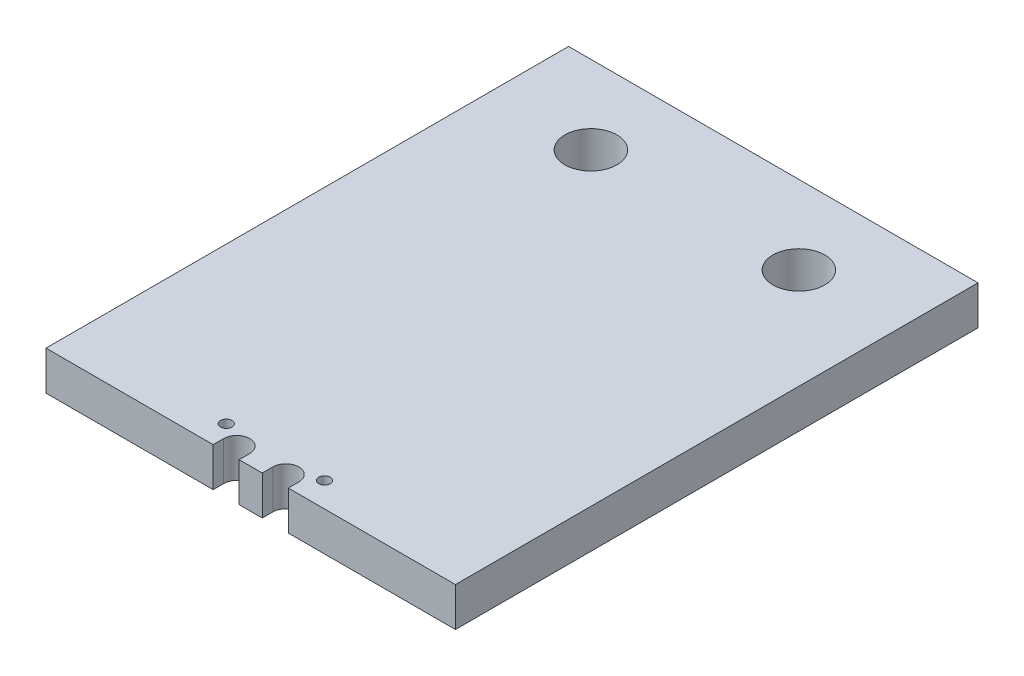
ISO-10303-21;
HEADER;
FILE_DESCRIPTION(('STEP AP214'),'2;1');
FILE_NAME('part.step','',(''),(''),'','','');
FILE_SCHEMA(('AUTOMOTIVE_DESIGN { 1 0 10303 214 1 1 1 1 }'));
ENDSEC;
DATA;
#1=APPLICATION_CONTEXT('core data for automotive mechanical design processes');
#2=APPLICATION_PROTOCOL_DEFINITION('international standard','automotive_design',2000,#1);
#3=PRODUCT_CONTEXT('',#1,'mechanical');
#4=PRODUCT('Part','Part','',(#3));
#5=PRODUCT_RELATED_PRODUCT_CATEGORY('part','',(#4));
#6=PRODUCT_DEFINITION_FORMATION('','',#4);
#7=PRODUCT_DEFINITION_CONTEXT('part definition',#1,'design');
#8=PRODUCT_DEFINITION('design','',#6,#7);
#9=PRODUCT_DEFINITION_SHAPE('','',#8);
#10=(LENGTH_UNIT() NAMED_UNIT(*) SI_UNIT(.MILLI.,.METRE.));
#11=(NAMED_UNIT(*) PLANE_ANGLE_UNIT() SI_UNIT($,.RADIAN.));
#12=(NAMED_UNIT(*) SI_UNIT($,.STERADIAN.) SOLID_ANGLE_UNIT());
#13=UNCERTAINTY_MEASURE_WITH_UNIT(LENGTH_MEASURE(1.E-05),#10,'distance_accuracy_value','');
#14=(GEOMETRIC_REPRESENTATION_CONTEXT(3) GLOBAL_UNCERTAINTY_ASSIGNED_CONTEXT((#13)) GLOBAL_UNIT_ASSIGNED_CONTEXT((#10,
#11,#12)) REPRESENTATION_CONTEXT('',''));
#15=CARTESIAN_POINT('',(0.,0.,0.));
#16=DIRECTION('',(0.,0.,1.));
#17=DIRECTION('',(1.,0.,0.));
#18=AXIS2_PLACEMENT_3D('',#15,#16,#17);
#19=CARTESIAN_POINT('',(16.,-4.7625,-1.18513126604703));
#20=DIRECTION('',(-1.,0.,0.));
#21=DIRECTION('',(0.,0.,1.));
#22=AXIS2_PLACEMENT_3D('',#19,#20,#21);
#23=PLANE('',#22);
#24=DIRECTION('',(0.,0.,1.));
#25=VECTOR('',#24,1.);
#26=CARTESIAN_POINT('',(16.,0.,-1.18513126604703));
#27=LINE('',#26,#25);
#28=CARTESIAN_POINT('',(16.,0.,-65.));
#29=VERTEX_POINT('',#28);
#30=CARTESIAN_POINT('',(16.,0.,-1.18513126604703));
#31=VERTEX_POINT('',#30);
#32=EDGE_CURVE('E154',#29,#31,#27,.T.);
#33=ORIENTED_EDGE('',*,*,#32,.F.);
#34=DIRECTION('',(0.,1.,0.));
#35=VECTOR('',#34,1.);
#36=CARTESIAN_POINT('',(16.,-4.7625,-65.));
#37=LINE('',#36,#35);
#38=CARTESIAN_POINT('',(16.,-4.7625,-65.));
#39=VERTEX_POINT('',#38);
#40=EDGE_CURVE('E11',#39,#29,#37,.T.);
#41=ORIENTED_EDGE('',*,*,#40,.F.);
#42=DIRECTION('',(0.,0.,1.));
#43=VECTOR('',#42,1.);
#44=CARTESIAN_POINT('',(16.,-4.7625,-1.18513126604703));
#45=LINE('',#44,#43);
#46=CARTESIAN_POINT('',(16.,-4.7625,-1.18513126604703));
#47=VERTEX_POINT('',#46);
#48=EDGE_CURVE('E187',#39,#47,#45,.T.);
#49=ORIENTED_EDGE('',*,*,#48,.T.);
#50=DIRECTION('',(0.,1.,0.));
#51=VECTOR('',#50,1.);
#52=CARTESIAN_POINT('',(16.,-4.7625,-1.18513126604703));
#53=LINE('',#52,#51);
#54=EDGE_CURVE('E36',#47,#31,#53,.T.);
#55=ORIENTED_EDGE('',*,*,#54,.T.);
#56=EDGE_LOOP('',(#33,#41,#49,#55));
#57=FACE_BOUND('',#56,.T.);
#58=ADVANCED_FACE('F33',(#57),#23,.T.);
#59=CARTESIAN_POINT('',(16.,-4.7625,-65.));
#60=DIRECTION('',(0.,0.,-1.));
#61=DIRECTION('',(-1.,0.,0.));
#62=AXIS2_PLACEMENT_3D('',#59,#60,#61);
#63=PLANE('',#62);
#64=DIRECTION('',(-1.,0.,0.));
#65=VECTOR('',#64,1.);
#66=CARTESIAN_POINT('',(16.,0.,-65.));
#67=LINE('',#66,#65);
#68=CARTESIAN_POINT('',(66.,0.,-65.));
#69=VERTEX_POINT('',#68);
#70=EDGE_CURVE('E185',#69,#29,#67,.T.);
#71=ORIENTED_EDGE('',*,*,#70,.F.);
#72=DIRECTION('',(0.,1.,0.));
#73=VECTOR('',#72,1.);
#74=CARTESIAN_POINT('',(66.,-4.7625,-65.));
#75=LINE('',#74,#73);
#76=CARTESIAN_POINT('',(66.,-4.7625,-65.));
#77=VERTEX_POINT('',#76);
#78=EDGE_CURVE('E42',#77,#69,#75,.T.);
#79=ORIENTED_EDGE('',*,*,#78,.F.);
#80=DIRECTION('',(-1.,0.,0.));
#81=VECTOR('',#80,1.);
#82=CARTESIAN_POINT('',(16.,-4.7625,-65.));
#83=LINE('',#82,#81);
#84=EDGE_CURVE('E144',#77,#39,#83,.T.);
#85=ORIENTED_EDGE('',*,*,#84,.T.);
#86=ORIENTED_EDGE('',*,*,#40,.T.);
#87=EDGE_LOOP('',(#71,#79,#85,#86));
#88=FACE_BOUND('',#87,.T.);
#89=ADVANCED_FACE('F207',(#88),#63,.T.);
#90=CARTESIAN_POINT('',(66.,-4.7625,-1.18513126604705));
#91=DIRECTION('',(1.,0.,0.));
#92=DIRECTION('',(0.,0.,-1.));
#93=AXIS2_PLACEMENT_3D('',#90,#91,#92);
#94=PLANE('',#93);
#95=DIRECTION('',(0.,0.,-1.));
#96=VECTOR('',#95,1.);
#97=CARTESIAN_POINT('',(66.,0.,-1.18513126604705));
#98=LINE('',#97,#96);
#99=CARTESIAN_POINT('',(66.,0.,-1.18513126604705));
#100=VERTEX_POINT('',#99);
#101=EDGE_CURVE('E131',#100,#69,#98,.T.);
#102=ORIENTED_EDGE('',*,*,#101,.F.);
#103=DIRECTION('',(0.,1.,0.));
#104=VECTOR('',#103,1.);
#105=CARTESIAN_POINT('',(66.,-4.7625,-1.18513126604705));
#106=LINE('',#105,#104);
#107=CARTESIAN_POINT('',(66.,-4.7625,-1.18513126604705));
#108=VERTEX_POINT('',#107);
#109=EDGE_CURVE('E126',#108,#100,#106,.T.);
#110=ORIENTED_EDGE('',*,*,#109,.F.);
#111=DIRECTION('',(0.,0.,-1.));
#112=VECTOR('',#111,1.);
#113=CARTESIAN_POINT('',(66.,-4.7625,-1.18513126604705));
#114=LINE('',#113,#112);
#115=EDGE_CURVE('E129',#108,#77,#114,.T.);
#116=ORIENTED_EDGE('',*,*,#115,.T.);
#117=ORIENTED_EDGE('',*,*,#78,.T.);
#118=EDGE_LOOP('',(#102,#110,#116,#117));
#119=FACE_BOUND('',#118,.T.);
#120=ADVANCED_FACE('F128',(#119),#94,.T.);
#121=CARTESIAN_POINT('',(66.,-4.7625,-1.18513126604705));
#122=DIRECTION('',(0.,0.,1.));
#123=DIRECTION('',(1.,0.,0.));
#124=AXIS2_PLACEMENT_3D('',#121,#122,#123);
#125=PLANE('',#124);
#126=DIRECTION('',(1.,0.,0.));
#127=VECTOR('',#126,1.);
#128=CARTESIAN_POINT('',(66.,0.,-1.18513126604705));
#129=LINE('',#128,#127);
#130=CARTESIAN_POINT('',(45.5875,0.,-1.18513126604703));
#131=VERTEX_POINT('',#130);
#132=EDGE_CURVE('E182',#131,#100,#129,.T.);
#133=ORIENTED_EDGE('',*,*,#132,.F.);
#134=DIRECTION('',(0.,1.,0.));
#135=VECTOR('',#134,1.);
#136=CARTESIAN_POINT('',(45.5875,-4.7625,-1.18513126604703));
#137=LINE('',#136,#135);
#138=CARTESIAN_POINT('',(45.5875,-4.7625,-1.18513126604703));
#139=VERTEX_POINT('',#138);
#140=EDGE_CURVE('E136',#139,#131,#137,.T.);
#141=ORIENTED_EDGE('',*,*,#140,.F.);
#142=DIRECTION('',(1.,0.,0.));
#143=VECTOR('',#142,1.);
#144=CARTESIAN_POINT('',(66.,-4.7625,-1.18513126604705));
#145=LINE('',#144,#143);
#146=EDGE_CURVE('E142',#139,#108,#145,.T.);
#147=ORIENTED_EDGE('',*,*,#146,.T.);
#148=ORIENTED_EDGE('',*,*,#109,.T.);
#149=EDGE_LOOP('',(#133,#141,#147,#148));
#150=FACE_BOUND('',#149,.T.);
#151=ADVANCED_FACE('F146',(#150),#125,.T.);
#152=CARTESIAN_POINT('',(45.5875,-4.7625,-2.47623547973613));
#153=DIRECTION('',(-1.,0.,0.));
#154=DIRECTION('',(0.,0.,1.));
#155=AXIS2_PLACEMENT_3D('',#152,#153,#154);
#156=PLANE('',#155);
#157=DIRECTION('',(0.,0.,1.));
#158=VECTOR('',#157,1.);
#159=CARTESIAN_POINT('',(45.5875,0.,-2.47623547973613));
#160=LINE('',#159,#158);
#161=CARTESIAN_POINT('',(45.5875,0.,-2.47623547973613));
#162=VERTEX_POINT('',#161);
#163=EDGE_CURVE('E179',#162,#131,#160,.T.);
#164=ORIENTED_EDGE('',*,*,#163,.F.);
#165=DIRECTION('',(0.,1.,0.));
#166=VECTOR('',#165,1.);
#167=CARTESIAN_POINT('',(45.5875,-4.7625,-2.47623547973613));
#168=LINE('',#167,#166);
#169=CARTESIAN_POINT('',(45.5875,-4.7625,-2.47623547973613));
#170=VERTEX_POINT('',#169);
#171=EDGE_CURVE('E191',#170,#162,#168,.T.);
#172=ORIENTED_EDGE('',*,*,#171,.F.);
#173=DIRECTION('',(0.,0.,1.));
#174=VECTOR('',#173,1.);
#175=CARTESIAN_POINT('',(45.5875,-4.7625,-2.47623547973613));
#176=LINE('',#175,#174);
#177=EDGE_CURVE('E147',#170,#139,#176,.T.);
#178=ORIENTED_EDGE('',*,*,#177,.T.);
#179=ORIENTED_EDGE('',*,*,#140,.T.);
#180=EDGE_LOOP('',(#164,#172,#178,#179));
#181=FACE_BOUND('',#180,.T.);
#182=ADVANCED_FACE('F220',(#181),#156,.T.);
#183=CARTESIAN_POINT('',(44.,-4.7625,-2.47623547973613));
#184=DIRECTION('',(0.,1.,0.));
#185=DIRECTION('',(0.,0.,1.));
#186=AXIS2_PLACEMENT_3D('',#183,#184,#185);
#187=CYLINDRICAL_SURFACE('',#186,1.5875);
#188=CARTESIAN_POINT('',(44.,0.,-2.47623547973613));
#189=DIRECTION('',(0.,-1.,0.));
#190=DIRECTION('',(0.,0.,-1.));
#191=AXIS2_PLACEMENT_3D('',#188,#189,#190);
#192=CIRCLE('',#191,1.5875);
#193=CARTESIAN_POINT('',(42.4125,0.,-2.47623547973613));
#194=VERTEX_POINT('',#193);
#195=EDGE_CURVE('E176',#194,#162,#192,.T.);
#196=ORIENTED_EDGE('',*,*,#195,.F.);
#197=DIRECTION('',(0.,1.,0.));
#198=VECTOR('',#197,1.);
#199=CARTESIAN_POINT('',(42.4125,-4.7625,-2.47623547973613));
#200=LINE('',#199,#198);
#201=CARTESIAN_POINT('',(42.4125,-4.7625,-2.47623547973613));
#202=VERTEX_POINT('',#201);
#203=EDGE_CURVE('E193',#202,#194,#200,.T.);
#204=ORIENTED_EDGE('',*,*,#203,.F.);
#205=CARTESIAN_POINT('',(44.,-4.7625,-2.47623547973613));
#206=DIRECTION('',(0.,-1.,0.));
#207=DIRECTION('',(0.,0.,-1.));
#208=AXIS2_PLACEMENT_3D('',#205,#206,#207);
#209=CIRCLE('',#208,1.5875);
#210=EDGE_CURVE('E149',#202,#170,#209,.T.);
#211=ORIENTED_EDGE('',*,*,#210,.T.);
#212=ORIENTED_EDGE('',*,*,#171,.T.);
#213=EDGE_LOOP('',(#196,#204,#211,#212));
#214=FACE_BOUND('',#213,.T.);
#215=ADVANCED_FACE('F223',(#214),#187,.F.);
#216=CARTESIAN_POINT('',(42.4125,-4.7625,-1.18513126604703));
#217=DIRECTION('',(1.,0.,0.));
#218=DIRECTION('',(0.,0.,-1.));
#219=AXIS2_PLACEMENT_3D('',#216,#217,#218);
#220=PLANE('',#219);
#221=DIRECTION('',(0.,0.,-1.));
#222=VECTOR('',#221,1.);
#223=CARTESIAN_POINT('',(42.4125,0.,-1.18513126604703));
#224=LINE('',#223,#222);
#225=CARTESIAN_POINT('',(42.4125,0.,-1.18513126604703));
#226=VERTEX_POINT('',#225);
#227=EDGE_CURVE('E173',#226,#194,#224,.T.);
#228=ORIENTED_EDGE('',*,*,#227,.F.);
#229=DIRECTION('',(0.,1.,0.));
#230=VECTOR('',#229,1.);
#231=CARTESIAN_POINT('',(42.4125,-4.7625,-1.18513126604703));
#232=LINE('',#231,#230);
#233=CARTESIAN_POINT('',(42.4125,-4.7625,-1.18513126604703));
#234=VERTEX_POINT('',#233);
#235=EDGE_CURVE('E195',#234,#226,#232,.T.);
#236=ORIENTED_EDGE('',*,*,#235,.F.);
#237=DIRECTION('',(0.,0.,-1.));
#238=VECTOR('',#237,1.);
#239=CARTESIAN_POINT('',(42.4125,-4.7625,-1.18513126604703));
#240=LINE('',#239,#238);
#241=EDGE_CURVE('E317',#234,#202,#240,.T.);
#242=ORIENTED_EDGE('',*,*,#241,.T.);
#243=ORIENTED_EDGE('',*,*,#203,.T.);
#244=EDGE_LOOP('',(#228,#236,#242,#243));
#245=FACE_BOUND('',#244,.T.);
#246=ADVANCED_FACE('F227',(#245),#220,.T.);
#247=CARTESIAN_POINT('',(42.4125,-4.7625,-1.18513126604703));
#248=DIRECTION('',(0.,0.,1.));
#249=DIRECTION('',(1.,0.,0.));
#250=AXIS2_PLACEMENT_3D('',#247,#248,#249);
#251=PLANE('',#250);
#252=DIRECTION('',(1.,0.,0.));
#253=VECTOR('',#252,1.);
#254=CARTESIAN_POINT('',(42.4125,0.,-1.18513126604703));
#255=LINE('',#254,#253);
#256=CARTESIAN_POINT('',(39.5875,0.,-1.18513126604703));
#257=VERTEX_POINT('',#256);
#258=EDGE_CURVE('E170',#257,#226,#255,.T.);
#259=ORIENTED_EDGE('',*,*,#258,.F.);
#260=DIRECTION('',(0.,1.,0.));
#261=VECTOR('',#260,1.);
#262=CARTESIAN_POINT('',(39.5875,-4.7625,-1.18513126604703));
#263=LINE('',#262,#261);
#264=CARTESIAN_POINT('',(39.5875,-4.7625,-1.18513126604703));
#265=VERTEX_POINT('',#264);
#266=EDGE_CURVE('E197',#265,#257,#263,.T.);
#267=ORIENTED_EDGE('',*,*,#266,.F.);
#268=DIRECTION('',(1.,0.,0.));
#269=VECTOR('',#268,1.);
#270=CARTESIAN_POINT('',(42.4125,-4.7625,-1.18513126604703));
#271=LINE('',#270,#269);
#272=EDGE_CURVE('E314',#265,#234,#271,.T.);
#273=ORIENTED_EDGE('',*,*,#272,.T.);
#274=ORIENTED_EDGE('',*,*,#235,.T.);
#275=EDGE_LOOP('',(#259,#267,#273,#274));
#276=FACE_BOUND('',#275,.T.);
#277=ADVANCED_FACE('F231',(#276),#251,.T.);
#278=CARTESIAN_POINT('',(39.5875,-4.7625,-2.47623547973613));
#279=DIRECTION('',(-1.,0.,0.));
#280=DIRECTION('',(0.,0.,1.));
#281=AXIS2_PLACEMENT_3D('',#278,#279,#280);
#282=PLANE('',#281);
#283=DIRECTION('',(0.,0.,1.));
#284=VECTOR('',#283,1.);
#285=CARTESIAN_POINT('',(39.5875,0.,-2.47623547973613));
#286=LINE('',#285,#284);
#287=CARTESIAN_POINT('',(39.5875,0.,-2.47623547973613));
#288=VERTEX_POINT('',#287);
#289=EDGE_CURVE('E167',#288,#257,#286,.T.);
#290=ORIENTED_EDGE('',*,*,#289,.F.);
#291=DIRECTION('',(0.,1.,0.));
#292=VECTOR('',#291,1.);
#293=CARTESIAN_POINT('',(39.5875,-4.7625,-2.47623547973613));
#294=LINE('',#293,#292);
#295=CARTESIAN_POINT('',(39.5875,-4.7625,-2.47623547973613));
#296=VERTEX_POINT('',#295);
#297=EDGE_CURVE('E199',#296,#288,#294,.T.);
#298=ORIENTED_EDGE('',*,*,#297,.F.);
#299=DIRECTION('',(0.,0.,1.));
#300=VECTOR('',#299,1.);
#301=CARTESIAN_POINT('',(39.5875,-4.7625,-2.47623547973613));
#302=LINE('',#301,#300);
#303=EDGE_CURVE('E311',#296,#265,#302,.T.);
#304=ORIENTED_EDGE('',*,*,#303,.T.);
#305=ORIENTED_EDGE('',*,*,#266,.T.);
#306=EDGE_LOOP('',(#290,#298,#304,#305));
#307=FACE_BOUND('',#306,.T.);
#308=ADVANCED_FACE('F235',(#307),#282,.T.);
#309=CARTESIAN_POINT('',(38.,-4.7625,-2.47623547973613));
#310=DIRECTION('',(0.,1.,0.));
#311=DIRECTION('',(0.,0.,1.));
#312=AXIS2_PLACEMENT_3D('',#309,#310,#311);
#313=CYLINDRICAL_SURFACE('',#312,1.5875);
#314=CARTESIAN_POINT('',(38.,0.,-2.47623547973613));
#315=DIRECTION('',(0.,-1.,0.));
#316=DIRECTION('',(0.,0.,-1.));
#317=AXIS2_PLACEMENT_3D('',#314,#315,#316);
#318=CIRCLE('',#317,1.5875);
#319=CARTESIAN_POINT('',(36.4125,0.,-2.47623547973613));
#320=VERTEX_POINT('',#319);
#321=EDGE_CURVE('E164',#320,#288,#318,.T.);
#322=ORIENTED_EDGE('',*,*,#321,.F.);
#323=DIRECTION('',(0.,1.,0.));
#324=VECTOR('',#323,1.);
#325=CARTESIAN_POINT('',(36.4125,-4.7625,-2.47623547973613));
#326=LINE('',#325,#324);
#327=CARTESIAN_POINT('',(36.4125,-4.7625,-2.47623547973613));
#328=VERTEX_POINT('',#327);
#329=EDGE_CURVE('E201',#328,#320,#326,.T.);
#330=ORIENTED_EDGE('',*,*,#329,.F.);
#331=CARTESIAN_POINT('',(38.,-4.7625,-2.47623547973613));
#332=DIRECTION('',(0.,-1.,0.));
#333=DIRECTION('',(0.,0.,-1.));
#334=AXIS2_PLACEMENT_3D('',#331,#332,#333);
#335=CIRCLE('',#334,1.5875);
#336=EDGE_CURVE('E308',#328,#296,#335,.T.);
#337=ORIENTED_EDGE('',*,*,#336,.T.);
#338=ORIENTED_EDGE('',*,*,#297,.T.);
#339=EDGE_LOOP('',(#322,#330,#337,#338));
#340=FACE_BOUND('',#339,.T.);
#341=ADVANCED_FACE('F239',(#340),#313,.F.);
#342=CARTESIAN_POINT('',(36.4125,-4.7625,-1.18513126604703));
#343=DIRECTION('',(1.,0.,0.));
#344=DIRECTION('',(0.,0.,-1.));
#345=AXIS2_PLACEMENT_3D('',#342,#343,#344);
#346=PLANE('',#345);
#347=DIRECTION('',(0.,0.,-1.));
#348=VECTOR('',#347,1.);
#349=CARTESIAN_POINT('',(36.4125,0.,-1.18513126604703));
#350=LINE('',#349,#348);
#351=CARTESIAN_POINT('',(36.4125,0.,-1.18513126604703));
#352=VERTEX_POINT('',#351);
#353=EDGE_CURVE('E161',#352,#320,#350,.T.);
#354=ORIENTED_EDGE('',*,*,#353,.F.);
#355=DIRECTION('',(0.,1.,0.));
#356=VECTOR('',#355,1.);
#357=CARTESIAN_POINT('',(36.4125,-4.7625,-1.18513126604703));
#358=LINE('',#357,#356);
#359=CARTESIAN_POINT('',(36.4125,-4.7625,-1.18513126604703));
#360=VERTEX_POINT('',#359);
#361=EDGE_CURVE('E202',#360,#352,#358,.T.);
#362=ORIENTED_EDGE('',*,*,#361,.F.);
#363=DIRECTION('',(0.,0.,-1.));
#364=VECTOR('',#363,1.);
#365=CARTESIAN_POINT('',(36.4125,-4.7625,-1.18513126604703));
#366=LINE('',#365,#364);
#367=EDGE_CURVE('E305',#360,#328,#366,.T.);
#368=ORIENTED_EDGE('',*,*,#367,.T.);
#369=ORIENTED_EDGE('',*,*,#329,.T.);
#370=EDGE_LOOP('',(#354,#362,#368,#369));
#371=FACE_BOUND('',#370,.T.);
#372=ADVANCED_FACE('F243',(#371),#346,.T.);
#373=CARTESIAN_POINT('',(16.,-4.7625,-1.18513126604703));
#374=DIRECTION('',(0.,0.,1.));
#375=DIRECTION('',(1.,0.,0.));
#376=AXIS2_PLACEMENT_3D('',#373,#374,#375);
#377=PLANE('',#376);
#378=DIRECTION('',(1.,0.,0.));
#379=VECTOR('',#378,1.);
#380=CARTESIAN_POINT('',(16.,0.,-1.18513126604703));
#381=LINE('',#380,#379);
#382=EDGE_CURVE('E157',#31,#352,#381,.T.);
#383=ORIENTED_EDGE('',*,*,#382,.F.);
#384=ORIENTED_EDGE('',*,*,#54,.F.);
#385=DIRECTION('',(1.,0.,0.));
#386=VECTOR('',#385,1.);
#387=CARTESIAN_POINT('',(16.,-4.7625,-1.18513126604703));
#388=LINE('',#387,#386);
#389=EDGE_CURVE('E303',#47,#360,#388,.T.);
#390=ORIENTED_EDGE('',*,*,#389,.T.);
#391=ORIENTED_EDGE('',*,*,#361,.T.);
#392=EDGE_LOOP('',(#383,#384,#390,#391));
#393=FACE_BOUND('',#392,.T.);
#394=ADVANCED_FACE('F204',(#393),#377,.T.);
#395=CARTESIAN_POINT('',(44.,-4.7625,-2.47623547973613));
#396=DIRECTION('',(0.,-1.,0.));
#397=DIRECTION('',(0.,0.,-1.));
#398=AXIS2_PLACEMENT_3D('',#395,#396,#397);
#399=PLANE('',#398);
#400=CARTESIAN_POINT('',(28.3,-4.7625,-55.4261221037908));
#401=DIRECTION('',(0.,1.,0.));
#402=DIRECTION('',(0.,0.,1.));
#403=AXIS2_PLACEMENT_3D('',#400,#401,#402);
#404=CIRCLE('',#403,3.175);
#405=CARTESIAN_POINT('',(28.3,-4.7625,-52.2511221037908));
#406=VERTEX_POINT('',#405);
#407=EDGE_CURVE('E278',#406,#406,#404,.T.);
#408=ORIENTED_EDGE('',*,*,#407,.T.);
#409=EDGE_LOOP('',(#408));
#410=FACE_BOUND('',#409,.T.);
#411=CARTESIAN_POINT('',(53.7,-4.7625,-55.4261221037908));
#412=DIRECTION('',(0.,1.,0.));
#413=DIRECTION('',(0.,0.,1.));
#414=AXIS2_PLACEMENT_3D('',#411,#412,#413);
#415=CIRCLE('',#414,3.175);
#416=CARTESIAN_POINT('',(53.7,-4.7625,-52.2511221037908));
#417=VERTEX_POINT('',#416);
#418=EDGE_CURVE('E286',#417,#417,#415,.T.);
#419=ORIENTED_EDGE('',*,*,#418,.T.);
#420=EDGE_LOOP('',(#419));
#421=FACE_BOUND('',#420,.T.);
#422=CARTESIAN_POINT('',(35.,-4.7625,-4.19732745948582));
#423=DIRECTION('',(0.,1.,0.));
#424=DIRECTION('',(0.,0.,1.));
#425=AXIS2_PLACEMENT_3D('',#422,#423,#424);
#426=CIRCLE('',#425,0.700000000000001);
#427=CARTESIAN_POINT('',(35.,-4.7625,-3.49732745948582));
#428=VERTEX_POINT('',#427);
#429=EDGE_CURVE('E292',#428,#428,#426,.T.);
#430=ORIENTED_EDGE('',*,*,#429,.T.);
#431=EDGE_LOOP('',(#430));
#432=FACE_BOUND('',#431,.T.);
#433=CARTESIAN_POINT('',(47.,-4.7625,-4.19732745948582));
#434=DIRECTION('',(0.,1.,0.));
#435=DIRECTION('',(0.,0.,1.));
#436=AXIS2_PLACEMENT_3D('',#433,#434,#435);
#437=CIRCLE('',#436,0.700000000000001);
#438=CARTESIAN_POINT('',(47.,-4.7625,-3.49732745948582));
#439=VERTEX_POINT('',#438);
#440=EDGE_CURVE('E158',#439,#439,#437,.T.);
#441=ORIENTED_EDGE('',*,*,#440,.T.);
#442=EDGE_LOOP('',(#441));
#443=FACE_BOUND('',#442,.T.);
#444=ORIENTED_EDGE('',*,*,#48,.F.);
#445=ORIENTED_EDGE('',*,*,#84,.F.);
#446=ORIENTED_EDGE('',*,*,#115,.F.);
#447=ORIENTED_EDGE('',*,*,#146,.F.);
#448=ORIENTED_EDGE('',*,*,#177,.F.);
#449=ORIENTED_EDGE('',*,*,#210,.F.);
#450=ORIENTED_EDGE('',*,*,#241,.F.);
#451=ORIENTED_EDGE('',*,*,#272,.F.);
#452=ORIENTED_EDGE('',*,*,#303,.F.);
#453=ORIENTED_EDGE('',*,*,#336,.F.);
#454=ORIENTED_EDGE('',*,*,#367,.F.);
#455=ORIENTED_EDGE('',*,*,#389,.F.);
#456=EDGE_LOOP('',(#444,#445,#446,#447,#448,#449,#450,#451,#452,#453,#454,#455));
#457=FACE_BOUND('',#456,.T.);
#458=ADVANCED_FACE('F140',(#410,#421,#432,#443,#457),#399,.T.);
#459=CARTESIAN_POINT('',(44.,0.,-2.47623547973613));
#460=DIRECTION('',(0.,-1.,0.));
#461=DIRECTION('',(0.,0.,-1.));
#462=AXIS2_PLACEMENT_3D('',#459,#460,#461);
#463=PLANE('',#462);
#464=CARTESIAN_POINT('',(28.3,0.,-55.4261221037908));
#465=DIRECTION('',(0.,1.,0.));
#466=DIRECTION('',(0.,0.,1.));
#467=AXIS2_PLACEMENT_3D('',#464,#465,#466);
#468=CIRCLE('',#467,3.175);
#469=CARTESIAN_POINT('',(28.3,0.,-52.2511221037908));
#470=VERTEX_POINT('',#469);
#471=EDGE_CURVE('E281',#470,#470,#468,.T.);
#472=ORIENTED_EDGE('',*,*,#471,.F.);
#473=EDGE_LOOP('',(#472));
#474=FACE_BOUND('',#473,.T.);
#475=CARTESIAN_POINT('',(53.7,0.,-55.4261221037908));
#476=DIRECTION('',(0.,1.,0.));
#477=DIRECTION('',(0.,0.,1.));
#478=AXIS2_PLACEMENT_3D('',#475,#476,#477);
#479=CIRCLE('',#478,3.175);
#480=CARTESIAN_POINT('',(53.7,0.,-52.2511221037908));
#481=VERTEX_POINT('',#480);
#482=EDGE_CURVE('E283',#481,#481,#479,.T.);
#483=ORIENTED_EDGE('',*,*,#482,.F.);
#484=EDGE_LOOP('',(#483));
#485=FACE_BOUND('',#484,.T.);
#486=CARTESIAN_POINT('',(35.,0.,-4.19732745948582));
#487=DIRECTION('',(0.,1.,0.));
#488=DIRECTION('',(0.,0.,1.));
#489=AXIS2_PLACEMENT_3D('',#486,#487,#488);
#490=CIRCLE('',#489,0.700000000000001);
#491=CARTESIAN_POINT('',(35.,0.,-3.49732745948582));
#492=VERTEX_POINT('',#491);
#493=EDGE_CURVE('E289',#492,#492,#490,.T.);
#494=ORIENTED_EDGE('',*,*,#493,.F.);
#495=EDGE_LOOP('',(#494));
#496=FACE_BOUND('',#495,.T.);
#497=CARTESIAN_POINT('',(47.,0.,-4.19732745948582));
#498=DIRECTION('',(0.,1.,0.));
#499=DIRECTION('',(0.,0.,1.));
#500=AXIS2_PLACEMENT_3D('',#497,#498,#499);
#501=CIRCLE('',#500,0.700000000000001);
#502=CARTESIAN_POINT('',(47.,0.,-3.49732745948582));
#503=VERTEX_POINT('',#502);
#504=EDGE_CURVE('E295',#503,#503,#501,.T.);
#505=ORIENTED_EDGE('',*,*,#504,.F.);
#506=EDGE_LOOP('',(#505));
#507=FACE_BOUND('',#506,.T.);
#508=ORIENTED_EDGE('',*,*,#32,.T.);
#509=ORIENTED_EDGE('',*,*,#382,.T.);
#510=ORIENTED_EDGE('',*,*,#353,.T.);
#511=ORIENTED_EDGE('',*,*,#321,.T.);
#512=ORIENTED_EDGE('',*,*,#289,.T.);
#513=ORIENTED_EDGE('',*,*,#258,.T.);
#514=ORIENTED_EDGE('',*,*,#227,.T.);
#515=ORIENTED_EDGE('',*,*,#195,.T.);
#516=ORIENTED_EDGE('',*,*,#163,.T.);
#517=ORIENTED_EDGE('',*,*,#132,.T.);
#518=ORIENTED_EDGE('',*,*,#101,.T.);
#519=ORIENTED_EDGE('',*,*,#70,.T.);
#520=EDGE_LOOP('',(#508,#509,#510,#511,#512,#513,#514,#515,#516,#517,#518,#519));
#521=FACE_BOUND('',#520,.T.);
#522=ADVANCED_FACE('F206',(#474,#485,#496,#507,#521),#463,.F.);
#523=CARTESIAN_POINT('',(47.,-4.7625,-4.19732745948582));
#524=DIRECTION('',(0.,1.,0.));
#525=DIRECTION('',(0.,0.,1.));
#526=AXIS2_PLACEMENT_3D('',#523,#524,#525);
#527=CYLINDRICAL_SURFACE('',#526,0.700000000000001);
#528=ORIENTED_EDGE('',*,*,#440,.F.);
#529=EDGE_LOOP('',(#528));
#530=FACE_BOUND('',#529,.T.);
#531=ORIENTED_EDGE('',*,*,#504,.T.);
#532=EDGE_LOOP('',(#531));
#533=FACE_BOUND('',#532,.T.);
#534=ADVANCED_FACE('F255',(#530,#533),#527,.F.);
#535=CARTESIAN_POINT('',(35.,-4.7625,-4.19732745948582));
#536=DIRECTION('',(0.,1.,0.));
#537=DIRECTION('',(0.,0.,1.));
#538=AXIS2_PLACEMENT_3D('',#535,#536,#537);
#539=CYLINDRICAL_SURFACE('',#538,0.700000000000001);
#540=ORIENTED_EDGE('',*,*,#429,.F.);
#541=EDGE_LOOP('',(#540));
#542=FACE_BOUND('',#541,.T.);
#543=ORIENTED_EDGE('',*,*,#493,.T.);
#544=EDGE_LOOP('',(#543));
#545=FACE_BOUND('',#544,.T.);
#546=ADVANCED_FACE('F262',(#542,#545),#539,.F.);
#547=CARTESIAN_POINT('',(53.7,-4.7625,-55.4261221037908));
#548=DIRECTION('',(0.,1.,0.));
#549=DIRECTION('',(0.,0.,1.));
#550=AXIS2_PLACEMENT_3D('',#547,#548,#549);
#551=CYLINDRICAL_SURFACE('',#550,3.175);
#552=ORIENTED_EDGE('',*,*,#418,.F.);
#553=EDGE_LOOP('',(#552));
#554=FACE_BOUND('',#553,.T.);
#555=ORIENTED_EDGE('',*,*,#482,.T.);
#556=EDGE_LOOP('',(#555));
#557=FACE_BOUND('',#556,.T.);
#558=ADVANCED_FACE('F266',(#554,#557),#551,.F.);
#559=CARTESIAN_POINT('',(28.3,-4.7625,-55.4261221037908));
#560=DIRECTION('',(0.,1.,0.));
#561=DIRECTION('',(0.,0.,1.));
#562=AXIS2_PLACEMENT_3D('',#559,#560,#561);
#563=CYLINDRICAL_SURFACE('',#562,3.175);
#564=ORIENTED_EDGE('',*,*,#407,.F.);
#565=EDGE_LOOP('',(#564));
#566=FACE_BOUND('',#565,.T.);
#567=ORIENTED_EDGE('',*,*,#471,.T.);
#568=EDGE_LOOP('',(#567));
#569=FACE_BOUND('',#568,.T.);
#570=ADVANCED_FACE('F270',(#566,#569),#563,.F.);
#571=CLOSED_SHELL('',(#58,#89,#120,#151,#182,#215,#246,#277,#308,#341,#372,#394,#458,#522,#534,
#546,#558,#570));
#572=MANIFOLD_SOLID_BREP('B2',#571);
#573=ADVANCED_BREP_SHAPE_REPRESENTATION('',(#18,#572),#14);
#574=SHAPE_DEFINITION_REPRESENTATION(#9,#573);
ENDSEC;
END-ISO-10303-21;
